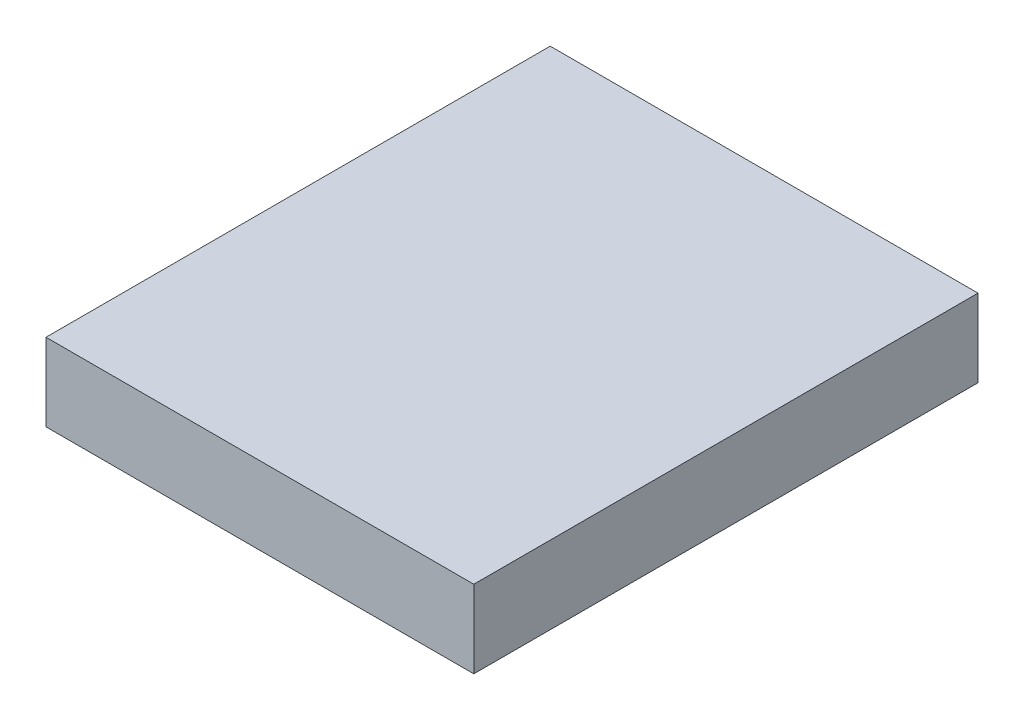
ISO-10303-21;
HEADER;
FILE_DESCRIPTION(('STEP AP214'),'2;1');
FILE_NAME('part.step','',(''),(''),'','','');
FILE_SCHEMA(('AUTOMOTIVE_DESIGN { 1 0 10303 214 1 1 1 1 }'));
ENDSEC;
DATA;
#1=APPLICATION_CONTEXT('core data for automotive mechanical design processes');
#2=APPLICATION_PROTOCOL_DEFINITION('international standard','automotive_design',2000,#1);
#3=PRODUCT_CONTEXT('',#1,'mechanical');
#4=PRODUCT('Part','Part','',(#3));
#5=PRODUCT_RELATED_PRODUCT_CATEGORY('part','',(#4));
#6=PRODUCT_DEFINITION_FORMATION('','',#4);
#7=PRODUCT_DEFINITION_CONTEXT('part definition',#1,'design');
#8=PRODUCT_DEFINITION('design','',#6,#7);
#9=PRODUCT_DEFINITION_SHAPE('','',#8);
#10=(LENGTH_UNIT() NAMED_UNIT(*) SI_UNIT(.MILLI.,.METRE.));
#11=(NAMED_UNIT(*) PLANE_ANGLE_UNIT() SI_UNIT($,.RADIAN.));
#12=(NAMED_UNIT(*) SI_UNIT($,.STERADIAN.) SOLID_ANGLE_UNIT());
#13=UNCERTAINTY_MEASURE_WITH_UNIT(LENGTH_MEASURE(1.E-05),#10,'distance_accuracy_value','');
#14=(GEOMETRIC_REPRESENTATION_CONTEXT(3) GLOBAL_UNCERTAINTY_ASSIGNED_CONTEXT((#13)) GLOBAL_UNIT_ASSIGNED_CONTEXT((#10,
#11,#12)) REPRESENTATION_CONTEXT('',''));
#15=CARTESIAN_POINT('',(0.,0.,0.));
#16=DIRECTION('',(0.,0.,1.));
#17=DIRECTION('',(1.,0.,0.));
#18=AXIS2_PLACEMENT_3D('',#15,#16,#17);
#19=CARTESIAN_POINT('',(0.,12.7,0.));
#20=DIRECTION('',(1.,0.,0.));
#21=DIRECTION('',(0.,0.,-1.));
#22=AXIS2_PLACEMENT_3D('',#19,#20,#21);
#23=PLANE('',#22);
#24=DIRECTION('',(0.,0.,1.));
#25=VECTOR('',#24,1.);
#26=CARTESIAN_POINT('',(0.,0.,0.));
#27=LINE('',#26,#25);
#28=CARTESIAN_POINT('',(0.,0.,-82.5));
#29=VERTEX_POINT('',#28);
#30=CARTESIAN_POINT('',(0.,0.,0.));
#31=VERTEX_POINT('',#30);
#32=EDGE_CURVE('E107',#29,#31,#27,.T.);
#33=ORIENTED_EDGE('',*,*,#32,.T.);
#34=DIRECTION('',(0.,-1.,0.));
#35=VECTOR('',#34,1.);
#36=CARTESIAN_POINT('',(0.,12.7,0.));
#37=LINE('',#36,#35);
#38=CARTESIAN_POINT('',(0.,12.7,0.));
#39=VERTEX_POINT('',#38);
#40=EDGE_CURVE('E11',#39,#31,#37,.T.);
#41=ORIENTED_EDGE('',*,*,#40,.F.);
#42=DIRECTION('',(0.,0.,1.));
#43=VECTOR('',#42,1.);
#44=CARTESIAN_POINT('',(0.,12.7,0.));
#45=LINE('',#44,#43);
#46=CARTESIAN_POINT('',(0.,12.7,-82.5));
#47=VERTEX_POINT('',#46);
#48=EDGE_CURVE('E91',#47,#39,#45,.T.);
#49=ORIENTED_EDGE('',*,*,#48,.F.);
#50=DIRECTION('',(0.,-1.,0.));
#51=VECTOR('',#50,1.);
#52=CARTESIAN_POINT('',(0.,12.7,-82.5));
#53=LINE('',#52,#51);
#54=EDGE_CURVE('E103',#47,#29,#53,.T.);
#55=ORIENTED_EDGE('',*,*,#54,.T.);
#56=EDGE_LOOP('',(#33,#41,#49,#55));
#57=FACE_BOUND('',#56,.T.);
#58=ADVANCED_FACE('F39',(#57),#23,.F.);
#59=CARTESIAN_POINT('',(0.,12.7,0.));
#60=DIRECTION('',(0.,0.,-1.));
#61=DIRECTION('',(-1.,0.,0.));
#62=AXIS2_PLACEMENT_3D('',#59,#60,#61);
#63=PLANE('',#62);
#64=DIRECTION('',(1.,0.,0.));
#65=VECTOR('',#64,1.);
#66=CARTESIAN_POINT('',(0.,0.,0.));
#67=LINE('',#66,#65);
#68=CARTESIAN_POINT('',(70.,0.,0.));
#69=VERTEX_POINT('',#68);
#70=EDGE_CURVE('E96',#31,#69,#67,.T.);
#71=ORIENTED_EDGE('',*,*,#70,.T.);
#72=DIRECTION('',(0.,-1.,0.));
#73=VECTOR('',#72,1.);
#74=CARTESIAN_POINT('',(70.,12.7,0.));
#75=LINE('',#74,#73);
#76=CARTESIAN_POINT('',(70.,12.7,0.));
#77=VERTEX_POINT('',#76);
#78=EDGE_CURVE('E48',#77,#69,#75,.T.);
#79=ORIENTED_EDGE('',*,*,#78,.F.);
#80=DIRECTION('',(1.,0.,0.));
#81=VECTOR('',#80,1.);
#82=CARTESIAN_POINT('',(0.,12.7,0.));
#83=LINE('',#82,#81);
#84=EDGE_CURVE('E86',#39,#77,#83,.T.);
#85=ORIENTED_EDGE('',*,*,#84,.F.);
#86=ORIENTED_EDGE('',*,*,#40,.T.);
#87=EDGE_LOOP('',(#71,#79,#85,#86));
#88=FACE_BOUND('',#87,.T.);
#89=ADVANCED_FACE('F95',(#88),#63,.F.);
#90=CARTESIAN_POINT('',(70.,12.7,0.));
#91=DIRECTION('',(-1.,0.,0.));
#92=DIRECTION('',(0.,0.,1.));
#93=AXIS2_PLACEMENT_3D('',#90,#91,#92);
#94=PLANE('',#93);
#95=DIRECTION('',(0.,0.,-1.));
#96=VECTOR('',#95,1.);
#97=CARTESIAN_POINT('',(70.,0.,0.));
#98=LINE('',#97,#96);
#99=CARTESIAN_POINT('',(70.,0.,-82.5));
#100=VERTEX_POINT('',#99);
#101=EDGE_CURVE('E73',#69,#100,#98,.T.);
#102=ORIENTED_EDGE('',*,*,#101,.T.);
#103=DIRECTION('',(0.,-1.,0.));
#104=VECTOR('',#103,1.);
#105=CARTESIAN_POINT('',(70.,12.7,-82.5));
#106=LINE('',#105,#104);
#107=CARTESIAN_POINT('',(70.,12.7,-82.5));
#108=VERTEX_POINT('',#107);
#109=EDGE_CURVE('E98',#108,#100,#106,.T.);
#110=ORIENTED_EDGE('',*,*,#109,.F.);
#111=DIRECTION('',(0.,0.,-1.));
#112=VECTOR('',#111,1.);
#113=CARTESIAN_POINT('',(70.,12.7,0.));
#114=LINE('',#113,#112);
#115=EDGE_CURVE('E89',#77,#108,#114,.T.);
#116=ORIENTED_EDGE('',*,*,#115,.F.);
#117=ORIENTED_EDGE('',*,*,#78,.T.);
#118=EDGE_LOOP('',(#102,#110,#116,#117));
#119=FACE_BOUND('',#118,.T.);
#120=ADVANCED_FACE('F99',(#119),#94,.F.);
#121=CARTESIAN_POINT('',(0.,12.7,-82.5));
#122=DIRECTION('',(0.,0.,1.));
#123=DIRECTION('',(1.,0.,0.));
#124=AXIS2_PLACEMENT_3D('',#121,#122,#123);
#125=PLANE('',#124);
#126=DIRECTION('',(-1.,0.,0.));
#127=VECTOR('',#126,1.);
#128=CARTESIAN_POINT('',(0.,0.,-82.5));
#129=LINE('',#128,#127);
#130=EDGE_CURVE('E79',#100,#29,#129,.T.);
#131=ORIENTED_EDGE('',*,*,#130,.T.);
#132=ORIENTED_EDGE('',*,*,#54,.F.);
#133=DIRECTION('',(-1.,0.,0.));
#134=VECTOR('',#133,1.);
#135=CARTESIAN_POINT('',(0.,12.7,-82.5));
#136=LINE('',#135,#134);
#137=EDGE_CURVE('E56',#108,#47,#136,.T.);
#138=ORIENTED_EDGE('',*,*,#137,.F.);
#139=ORIENTED_EDGE('',*,*,#109,.T.);
#140=EDGE_LOOP('',(#131,#132,#138,#139));
#141=FACE_BOUND('',#140,.T.);
#142=ADVANCED_FACE('F120',(#141),#125,.F.);
#143=CARTESIAN_POINT('',(0.,12.7,0.));
#144=DIRECTION('',(0.,-1.,0.));
#145=DIRECTION('',(0.,0.,-1.));
#146=AXIS2_PLACEMENT_3D('',#143,#144,#145);
#147=PLANE('',#146);
#148=ORIENTED_EDGE('',*,*,#48,.T.);
#149=ORIENTED_EDGE('',*,*,#84,.T.);
#150=ORIENTED_EDGE('',*,*,#115,.T.);
#151=ORIENTED_EDGE('',*,*,#137,.T.);
#152=EDGE_LOOP('',(#148,#149,#150,#151));
#153=FACE_BOUND('',#152,.T.);
#154=ADVANCED_FACE('F87',(#153),#147,.F.);
#155=CARTESIAN_POINT('',(0.,0.,0.));
#156=DIRECTION('',(0.,-1.,0.));
#157=DIRECTION('',(0.,0.,-1.));
#158=AXIS2_PLACEMENT_3D('',#155,#156,#157);
#159=PLANE('',#158);
#160=ORIENTED_EDGE('',*,*,#32,.F.);
#161=ORIENTED_EDGE('',*,*,#130,.F.);
#162=ORIENTED_EDGE('',*,*,#101,.F.);
#163=ORIENTED_EDGE('',*,*,#70,.F.);
#164=EDGE_LOOP('',(#160,#161,#162,#163));
#165=FACE_BOUND('',#164,.T.);
#166=ADVANCED_FACE('F123',(#165),#159,.T.);
#167=CLOSED_SHELL('',(#58,#89,#120,#142,#154,#166));
#168=MANIFOLD_SOLID_BREP('B2',#167);
#169=ADVANCED_BREP_SHAPE_REPRESENTATION('',(#18,#168),#14);
#170=SHAPE_DEFINITION_REPRESENTATION(#9,#169);
ENDSEC;
END-ISO-10303-21;
